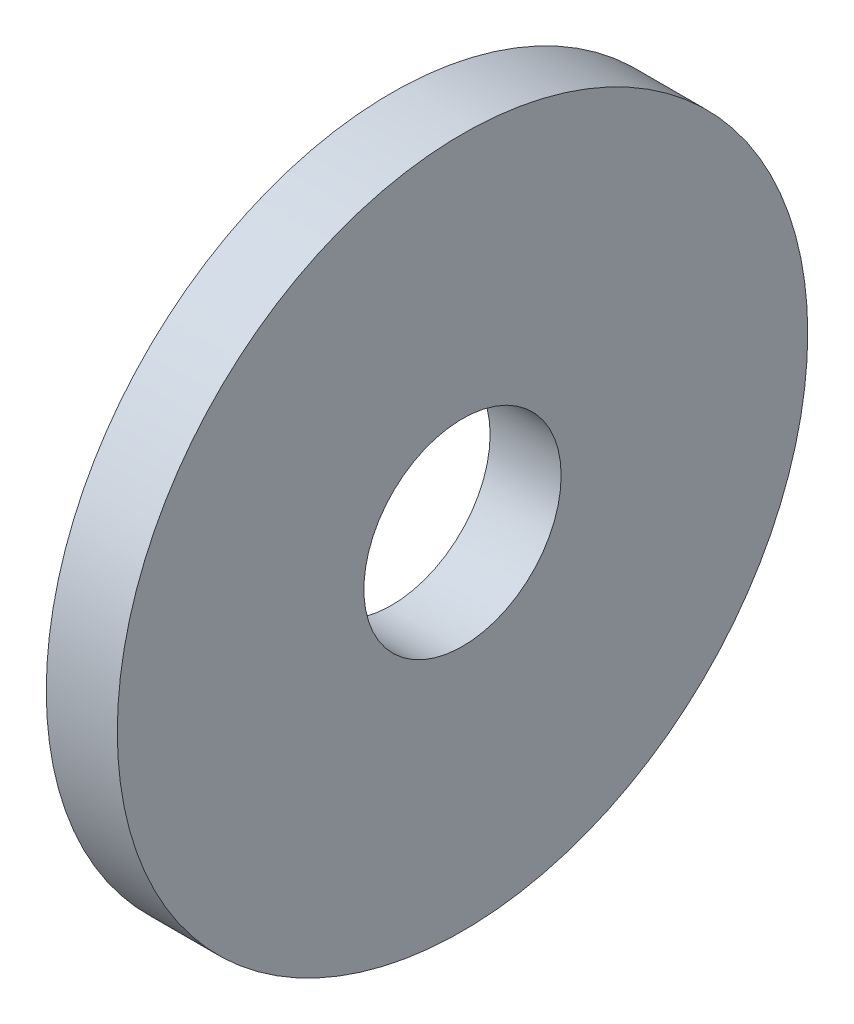
ISO-10303-21;
HEADER;
FILE_DESCRIPTION(('STEP AP214'),'2;1');
FILE_NAME('part.step','',(''),(''),'','','');
FILE_SCHEMA(('AUTOMOTIVE_DESIGN { 1 0 10303 214 1 1 1 1 }'));
ENDSEC;
DATA;
#1=APPLICATION_CONTEXT('core data for automotive mechanical design processes');
#2=APPLICATION_PROTOCOL_DEFINITION('international standard','automotive_design',2000,#1);
#3=PRODUCT_CONTEXT('',#1,'mechanical');
#4=PRODUCT('Part','Part','',(#3));
#5=PRODUCT_RELATED_PRODUCT_CATEGORY('part','',(#4));
#6=PRODUCT_DEFINITION_FORMATION('','',#4);
#7=PRODUCT_DEFINITION_CONTEXT('part definition',#1,'design');
#8=PRODUCT_DEFINITION('design','',#6,#7);
#9=PRODUCT_DEFINITION_SHAPE('','',#8);
#10=(LENGTH_UNIT() NAMED_UNIT(*) SI_UNIT(.MILLI.,.METRE.));
#11=(NAMED_UNIT(*) PLANE_ANGLE_UNIT() SI_UNIT($,.RADIAN.));
#12=(NAMED_UNIT(*) SI_UNIT($,.STERADIAN.) SOLID_ANGLE_UNIT());
#13=UNCERTAINTY_MEASURE_WITH_UNIT(LENGTH_MEASURE(1.E-05),#10,'distance_accuracy_value','');
#14=(GEOMETRIC_REPRESENTATION_CONTEXT(3) GLOBAL_UNCERTAINTY_ASSIGNED_CONTEXT((#13)) GLOBAL_UNIT_ASSIGNED_CONTEXT((#10,
#11,#12)) REPRESENTATION_CONTEXT('',''));
#15=CARTESIAN_POINT('',(0.,0.,0.));
#16=DIRECTION('',(0.,0.,1.));
#17=DIRECTION('',(1.,0.,0.));
#18=AXIS2_PLACEMENT_3D('',#15,#16,#17);
#19=CARTESIAN_POINT('',(1.143,0.,0.));
#20=DIRECTION('',(1.,0.,0.));
#21=DIRECTION('',(0.,0.,-1.));
#22=AXIS2_PLACEMENT_3D('',#19,#20,#21);
#23=PLANE('',#22);
#24=CARTESIAN_POINT('',(1.143,0.,0.));
#25=DIRECTION('',(1.,0.,0.));
#26=DIRECTION('',(0.,0.,-1.));
#27=AXIS2_PLACEMENT_3D('',#24,#25,#26);
#28=CIRCLE('',#27,5.55625);
#29=CARTESIAN_POINT('',(1.143,0.,-5.55625));
#30=VERTEX_POINT('',#29);
#31=EDGE_CURVE('E10',#30,#30,#28,.T.);
#32=ORIENTED_EDGE('',*,*,#31,.T.);
#33=EDGE_LOOP('',(#32));
#34=FACE_BOUND('',#33,.T.);
#35=CARTESIAN_POINT('',(1.143,0.,0.));
#36=DIRECTION('',(1.,0.,0.));
#37=DIRECTION('',(0.,0.,-1.));
#38=AXIS2_PLACEMENT_3D('',#35,#36,#37);
#39=CIRCLE('',#38,1.5875);
#40=CARTESIAN_POINT('',(1.143,0.,-1.5875));
#41=VERTEX_POINT('',#40);
#42=EDGE_CURVE('E41',#41,#41,#39,.T.);
#43=ORIENTED_EDGE('',*,*,#42,.F.);
#44=EDGE_LOOP('',(#43));
#45=FACE_BOUND('',#44,.T.);
#46=ADVANCED_FACE('F30',(#34,#45),#23,.T.);
#47=CARTESIAN_POINT('',(0.,0.,0.));
#48=DIRECTION('',(1.,0.,0.));
#49=DIRECTION('',(0.,0.,-1.));
#50=AXIS2_PLACEMENT_3D('',#47,#48,#49);
#51=PLANE('',#50);
#52=CARTESIAN_POINT('',(0.,0.,0.));
#53=DIRECTION('',(1.,0.,0.));
#54=DIRECTION('',(0.,0.,-1.));
#55=AXIS2_PLACEMENT_3D('',#52,#53,#54);
#56=CIRCLE('',#55,5.55625);
#57=CARTESIAN_POINT('',(0.,0.,-5.55625));
#58=VERTEX_POINT('',#57);
#59=EDGE_CURVE('E34',#58,#58,#56,.T.);
#60=ORIENTED_EDGE('',*,*,#59,.F.);
#61=EDGE_LOOP('',(#60));
#62=FACE_BOUND('',#61,.T.);
#63=CARTESIAN_POINT('',(0.,0.,0.));
#64=DIRECTION('',(1.,0.,0.));
#65=DIRECTION('',(0.,0.,-1.));
#66=AXIS2_PLACEMENT_3D('',#63,#64,#65);
#67=CIRCLE('',#66,1.5875);
#68=CARTESIAN_POINT('',(0.,0.,-1.5875));
#69=VERTEX_POINT('',#68);
#70=EDGE_CURVE('E43',#69,#69,#67,.T.);
#71=ORIENTED_EDGE('',*,*,#70,.T.);
#72=EDGE_LOOP('',(#71));
#73=FACE_BOUND('',#72,.T.);
#74=ADVANCED_FACE('F53',(#62,#73),#51,.F.);
#75=CARTESIAN_POINT('',(1.143,0.,0.));
#76=DIRECTION('',(-1.,0.,0.));
#77=DIRECTION('',(0.,0.,1.));
#78=AXIS2_PLACEMENT_3D('',#75,#76,#77);
#79=CYLINDRICAL_SURFACE('',#78,5.55625);
#80=ORIENTED_EDGE('',*,*,#31,.F.);
#81=EDGE_LOOP('',(#80));
#82=FACE_BOUND('',#81,.T.);
#83=ORIENTED_EDGE('',*,*,#59,.T.);
#84=EDGE_LOOP('',(#83));
#85=FACE_BOUND('',#84,.T.);
#86=ADVANCED_FACE('F32',(#82,#85),#79,.T.);
#87=CARTESIAN_POINT('',(1.143,0.,0.));
#88=DIRECTION('',(-1.,0.,0.));
#89=DIRECTION('',(0.,0.,1.));
#90=AXIS2_PLACEMENT_3D('',#87,#88,#89);
#91=CYLINDRICAL_SURFACE('',#90,1.5875);
#92=ORIENTED_EDGE('',*,*,#42,.T.);
#93=EDGE_LOOP('',(#92));
#94=FACE_BOUND('',#93,.T.);
#95=ORIENTED_EDGE('',*,*,#70,.F.);
#96=EDGE_LOOP('',(#95));
#97=FACE_BOUND('',#96,.T.);
#98=ADVANCED_FACE('F49',(#94,#97),#91,.F.);
#99=CLOSED_SHELL('',(#46,#74,#86,#98));
#100=MANIFOLD_SOLID_BREP('B2',#99);
#101=ADVANCED_BREP_SHAPE_REPRESENTATION('',(#18,#100),#14);
#102=SHAPE_DEFINITION_REPRESENTATION(#9,#101);
ENDSEC;
END-ISO-10303-21;
